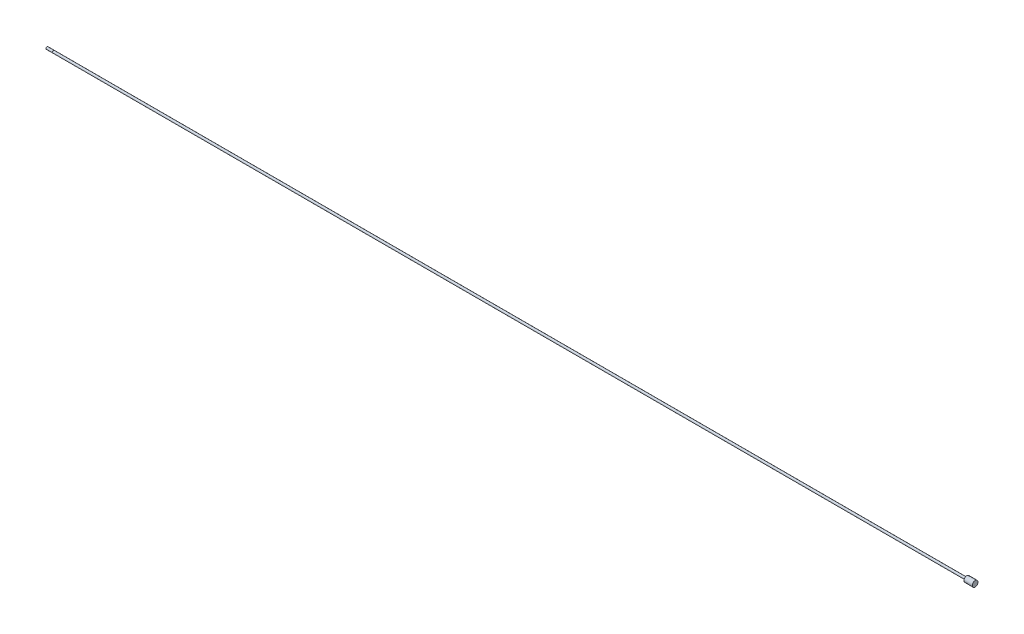
ISO-10303-21;
HEADER;
FILE_DESCRIPTION(('STEP AP214'),'2;1');
FILE_NAME('part.step','',(''),(''),'','','');
FILE_SCHEMA(('AUTOMOTIVE_DESIGN { 1 0 10303 214 1 1 1 1 }'));
ENDSEC;
DATA;
#1=APPLICATION_CONTEXT('core data for automotive mechanical design processes');
#2=APPLICATION_PROTOCOL_DEFINITION('international standard','automotive_design',2000,#1);
#3=PRODUCT_CONTEXT('',#1,'mechanical');
#4=PRODUCT('Part','Part','',(#3));
#5=PRODUCT_RELATED_PRODUCT_CATEGORY('part','',(#4));
#6=PRODUCT_DEFINITION_FORMATION('','',#4);
#7=PRODUCT_DEFINITION_CONTEXT('part definition',#1,'design');
#8=PRODUCT_DEFINITION('design','',#6,#7);
#9=PRODUCT_DEFINITION_SHAPE('','',#8);
#10=(LENGTH_UNIT() NAMED_UNIT(*) SI_UNIT(.MILLI.,.METRE.));
#11=(NAMED_UNIT(*) PLANE_ANGLE_UNIT() SI_UNIT($,.RADIAN.));
#12=(NAMED_UNIT(*) SI_UNIT($,.STERADIAN.) SOLID_ANGLE_UNIT());
#13=UNCERTAINTY_MEASURE_WITH_UNIT(LENGTH_MEASURE(1.E-05),#10,'distance_accuracy_value','');
#14=(GEOMETRIC_REPRESENTATION_CONTEXT(3) GLOBAL_UNCERTAINTY_ASSIGNED_CONTEXT((#13)) GLOBAL_UNIT_ASSIGNED_CONTEXT((#10,
#11,#12)) REPRESENTATION_CONTEXT('',''));
#15=CARTESIAN_POINT('',(0.,0.,0.));
#16=DIRECTION('',(0.,0.,1.));
#17=DIRECTION('',(1.,0.,0.));
#18=AXIS2_PLACEMENT_3D('',#15,#16,#17);
#19=CARTESIAN_POINT('',(1303.3248,0.,0.));
#20=DIRECTION('',(-1.,0.,0.));
#21=DIRECTION('',(0.,0.,1.));
#22=AXIS2_PLACEMENT_3D('',#19,#20,#21);
#23=CYLINDRICAL_SURFACE('',#22,1.5875);
#24=CARTESIAN_POINT('',(1291.463,0.,0.));
#25=DIRECTION('',(-1.,0.,0.));
#26=DIRECTION('',(0.,0.,1.));
#27=AXIS2_PLACEMENT_3D('',#24,#25,#26);
#28=CIRCLE('',#27,1.5875);
#29=CARTESIAN_POINT('',(1291.463,0.,1.5875));
#30=VERTEX_POINT('',#29);
#31=EDGE_CURVE('E10',#30,#30,#28,.T.);
#32=ORIENTED_EDGE('',*,*,#31,.T.);
#33=EDGE_LOOP('',(#32));
#34=FACE_BOUND('',#33,.T.);
#35=CARTESIAN_POINT('',(0.,0.,0.));
#36=DIRECTION('',(-1.,0.,0.));
#37=DIRECTION('',(0.,0.,1.));
#38=AXIS2_PLACEMENT_3D('',#35,#36,#37);
#39=CIRCLE('',#38,1.5875);
#40=CARTESIAN_POINT('',(0.,0.,1.5875));
#41=VERTEX_POINT('',#40);
#42=EDGE_CURVE('E51',#41,#41,#39,.T.);
#43=ORIENTED_EDGE('',*,*,#42,.F.);
#44=EDGE_LOOP('',(#43));
#45=FACE_BOUND('',#44,.T.);
#46=ADVANCED_FACE('F35',(#34,#45),#23,.T.);
#47=CARTESIAN_POINT('',(1291.463,1.5875,0.));
#48=DIRECTION('',(1.,0.,0.));
#49=DIRECTION('',(0.,0.,-1.));
#50=AXIS2_PLACEMENT_3D('',#47,#48,#49);
#51=PLANE('',#50);
#52=ORIENTED_EDGE('',*,*,#31,.F.);
#53=EDGE_LOOP('',(#52));
#54=FACE_BOUND('',#53,.T.);
#55=CARTESIAN_POINT('',(1291.463,0.,0.));
#56=DIRECTION('',(-1.,0.,0.));
#57=DIRECTION('',(0.,0.,1.));
#58=AXIS2_PLACEMENT_3D('',#55,#56,#57);
#59=CIRCLE('',#58,4.03225);
#60=CARTESIAN_POINT('',(1291.463,0.,4.03225));
#61=VERTEX_POINT('',#60);
#62=EDGE_CURVE('E43',#61,#61,#59,.T.);
#63=ORIENTED_EDGE('',*,*,#62,.T.);
#64=EDGE_LOOP('',(#63));
#65=FACE_BOUND('',#64,.T.);
#66=ADVANCED_FACE('F85',(#54,#65),#51,.F.);
#67=CARTESIAN_POINT('',(1303.3248,0.,0.));
#68=DIRECTION('',(-1.,0.,0.));
#69=DIRECTION('',(0.,0.,1.));
#70=AXIS2_PLACEMENT_3D('',#67,#68,#69);
#71=CYLINDRICAL_SURFACE('',#70,4.03225);
#72=ORIENTED_EDGE('',*,*,#62,.F.);
#73=EDGE_LOOP('',(#72));
#74=FACE_BOUND('',#73,.T.);
#75=CARTESIAN_POINT('',(1303.3248,0.,0.));
#76=DIRECTION('',(-1.,0.,0.));
#77=DIRECTION('',(0.,0.,1.));
#78=AXIS2_PLACEMENT_3D('',#75,#76,#77);
#79=CIRCLE('',#78,4.03225);
#80=CARTESIAN_POINT('',(1303.3248,0.,4.03225));
#81=VERTEX_POINT('',#80);
#82=EDGE_CURVE('E48',#81,#81,#79,.T.);
#83=ORIENTED_EDGE('',*,*,#82,.T.);
#84=EDGE_LOOP('',(#83));
#85=FACE_BOUND('',#84,.T.);
#86=ADVANCED_FACE('F73',(#74,#85),#71,.T.);
#87=CARTESIAN_POINT('',(1303.3248,4.03225,0.));
#88=DIRECTION('',(-1.,0.,0.));
#89=DIRECTION('',(0.,0.,1.));
#90=AXIS2_PLACEMENT_3D('',#87,#88,#89);
#91=PLANE('',#90);
#92=ORIENTED_EDGE('',*,*,#82,.F.);
#93=EDGE_LOOP('',(#92));
#94=FACE_BOUND('',#93,.T.);
#95=ADVANCED_FACE('F75',(#94),#91,.F.);
#96=CARTESIAN_POINT('',(-0.254,1.8415,0.));
#97=DIRECTION('',(1.,0.,0.));
#98=DIRECTION('',(0.,0.,-1.));
#99=AXIS2_PLACEMENT_3D('',#96,#97,#98);
#100=PLANE('',#99);
#101=CARTESIAN_POINT('',(-0.254,0.,0.));
#102=DIRECTION('',(-1.,0.,0.));
#103=DIRECTION('',(0.,0.,1.));
#104=AXIS2_PLACEMENT_3D('',#101,#102,#103);
#105=CIRCLE('',#104,1.3335);
#106=CARTESIAN_POINT('',(-0.254,0.,1.3335));
#107=VERTEX_POINT('',#106);
#108=EDGE_CURVE('E53',#107,#107,#105,.T.);
#109=ORIENTED_EDGE('',*,*,#108,.T.);
#110=EDGE_LOOP('',(#109));
#111=FACE_BOUND('',#110,.T.);
#112=CARTESIAN_POINT('',(-0.253999999999976,0.,0.));
#113=DIRECTION('',(1.,0.,0.));
#114=DIRECTION('',(0.,0.,-1.));
#115=AXIS2_PLACEMENT_3D('',#112,#113,#114);
#116=CIRCLE('',#115,1.5875);
#117=CARTESIAN_POINT('',(-0.253999999999976,0.,-1.5875));
#118=VERTEX_POINT('',#117);
#119=EDGE_CURVE('E39',#118,#118,#116,.T.);
#120=ORIENTED_EDGE('',*,*,#119,.T.);
#121=EDGE_LOOP('',(#120));
#122=FACE_BOUND('',#121,.T.);
#123=ADVANCED_FACE('F77',(#111,#122),#100,.T.);
#124=CARTESIAN_POINT('',(0.,1.3335,0.));
#125=DIRECTION('',(-1.,0.,0.));
#126=DIRECTION('',(0.,0.,1.));
#127=AXIS2_PLACEMENT_3D('',#124,#125,#126);
#128=PLANE('',#127);
#129=CARTESIAN_POINT('',(0.,0.,0.));
#130=DIRECTION('',(-1.,0.,0.));
#131=DIRECTION('',(0.,0.,1.));
#132=AXIS2_PLACEMENT_3D('',#129,#130,#131);
#133=CIRCLE('',#132,1.3335);
#134=CARTESIAN_POINT('',(0.,0.,1.3335));
#135=VERTEX_POINT('',#134);
#136=EDGE_CURVE('E59',#135,#135,#133,.T.);
#137=ORIENTED_EDGE('',*,*,#136,.F.);
#138=EDGE_LOOP('',(#137));
#139=FACE_BOUND('',#138,.T.);
#140=ORIENTED_EDGE('',*,*,#42,.T.);
#141=EDGE_LOOP('',(#140));
#142=FACE_BOUND('',#141,.T.);
#143=ADVANCED_FACE('F83',(#139,#142),#128,.T.);
#144=CARTESIAN_POINT('',(0.,0.,0.));
#145=DIRECTION('',(-1.,0.,0.));
#146=DIRECTION('',(0.,0.,1.));
#147=AXIS2_PLACEMENT_3D('',#144,#145,#146);
#148=CYLINDRICAL_SURFACE('',#147,1.3335);
#149=ORIENTED_EDGE('',*,*,#136,.T.);
#150=EDGE_LOOP('',(#149));
#151=FACE_BOUND('',#150,.T.);
#152=ORIENTED_EDGE('',*,*,#108,.F.);
#153=EDGE_LOOP('',(#152));
#154=FACE_BOUND('',#153,.T.);
#155=ADVANCED_FACE('F112',(#151,#154),#148,.T.);
#156=CARTESIAN_POINT('',(-9.652,0.,0.));
#157=DIRECTION('',(1.,0.,0.));
#158=DIRECTION('',(0.,0.,-1.));
#159=AXIS2_PLACEMENT_3D('',#156,#157,#158);
#160=PLANE('',#159);
#161=CARTESIAN_POINT('',(-9.652,0.,0.));
#162=DIRECTION('',(-1.,0.,0.));
#163=DIRECTION('',(0.,0.,1.));
#164=AXIS2_PLACEMENT_3D('',#161,#162,#163);
#165=CIRCLE('',#164,1.20904);
#166=CARTESIAN_POINT('',(-9.652,0.,1.20904));
#167=VERTEX_POINT('',#166);
#168=EDGE_CURVE('E68',#167,#167,#165,.T.);
#169=ORIENTED_EDGE('',*,*,#168,.T.);
#170=EDGE_LOOP('',(#169));
#171=FACE_BOUND('',#170,.T.);
#172=ADVANCED_FACE('F101',(#171),#160,.F.);
#173=CARTESIAN_POINT('',(-9.27354,0.,0.));
#174=DIRECTION('',(1.,0.,0.));
#175=DIRECTION('',(0.,0.,-1.));
#176=AXIS2_PLACEMENT_3D('',#173,#174,#175);
#177=CONICAL_SURFACE('',#176,1.5875,0.78539816339745);
#178=ORIENTED_EDGE('',*,*,#168,.F.);
#179=EDGE_LOOP('',(#178));
#180=FACE_BOUND('',#179,.T.);
#181=CARTESIAN_POINT('',(-9.27354,0.,0.));
#182=DIRECTION('',(-1.,0.,0.));
#183=DIRECTION('',(0.,0.,1.));
#184=AXIS2_PLACEMENT_3D('',#181,#182,#183);
#185=CIRCLE('',#184,1.5875);
#186=CARTESIAN_POINT('',(-9.27354,0.,1.5875));
#187=VERTEX_POINT('',#186);
#188=EDGE_CURVE('E57',#187,#187,#185,.T.);
#189=ORIENTED_EDGE('',*,*,#188,.T.);
#190=EDGE_LOOP('',(#189));
#191=FACE_BOUND('',#190,.T.);
#192=ADVANCED_FACE('F96',(#180,#191),#177,.T.);
#193=ORIENTED_EDGE('',*,*,#188,.F.);
#194=EDGE_LOOP('',(#193));
#195=FACE_BOUND('',#194,.T.);
#196=ORIENTED_EDGE('',*,*,#119,.F.);
#197=EDGE_LOOP('',(#196));
#198=FACE_BOUND('',#197,.T.);
#199=ADVANCED_FACE('F37',(#195,#198),#23,.T.);
#200=CLOSED_SHELL('',(#46,#66,#86,#95,#123,#143,#155,#172,#192,#199));
#201=MANIFOLD_SOLID_BREP('B2',#200);
#202=ADVANCED_BREP_SHAPE_REPRESENTATION('',(#18,#201),#14);
#203=SHAPE_DEFINITION_REPRESENTATION(#9,#202);
ENDSEC;
END-ISO-10303-21;
